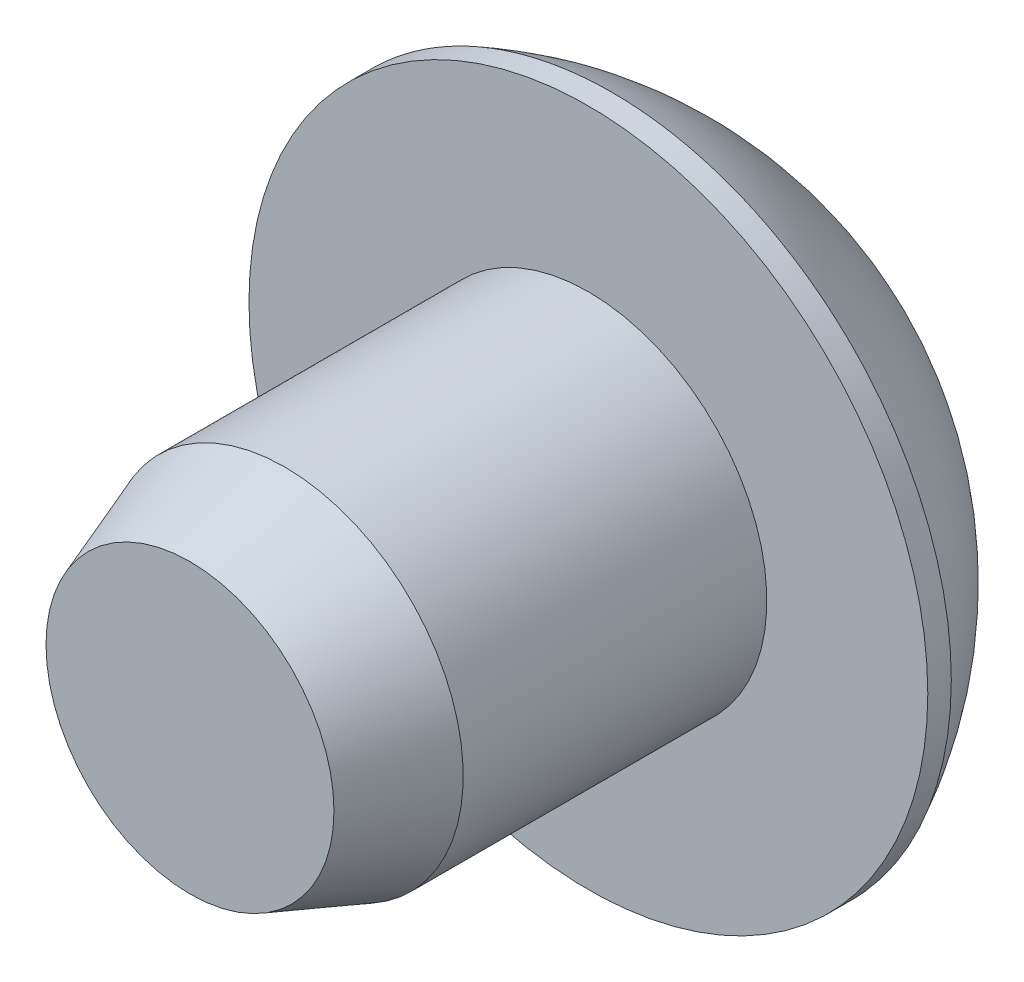
ISO-10303-21;
HEADER;
FILE_DESCRIPTION(('STEP AP214'),'2;1');
FILE_NAME('part.step','',(''),(''),'','','');
FILE_SCHEMA(('AUTOMOTIVE_DESIGN { 1 0 10303 214 1 1 1 1 }'));
ENDSEC;
DATA;
#1=APPLICATION_CONTEXT('core data for automotive mechanical design processes');
#2=APPLICATION_PROTOCOL_DEFINITION('international standard','automotive_design',2000,#1);
#3=PRODUCT_CONTEXT('',#1,'mechanical');
#4=PRODUCT('Part','Part','',(#3));
#5=PRODUCT_RELATED_PRODUCT_CATEGORY('part','',(#4));
#6=PRODUCT_DEFINITION_FORMATION('','',#4);
#7=PRODUCT_DEFINITION_CONTEXT('part definition',#1,'design');
#8=PRODUCT_DEFINITION('design','',#6,#7);
#9=PRODUCT_DEFINITION_SHAPE('','',#8);
#10=(LENGTH_UNIT() NAMED_UNIT(*) SI_UNIT(.MILLI.,.METRE.));
#11=(NAMED_UNIT(*) PLANE_ANGLE_UNIT() SI_UNIT($,.RADIAN.));
#12=(NAMED_UNIT(*) SI_UNIT($,.STERADIAN.) SOLID_ANGLE_UNIT());
#13=UNCERTAINTY_MEASURE_WITH_UNIT(LENGTH_MEASURE(1.E-05),#10,'distance_accuracy_value','');
#14=(GEOMETRIC_REPRESENTATION_CONTEXT(3) GLOBAL_UNCERTAINTY_ASSIGNED_CONTEXT((#13)) GLOBAL_UNIT_ASSIGNED_CONTEXT((#10,
#11,#12)) REPRESENTATION_CONTEXT('',''));
#15=CARTESIAN_POINT('',(0.,0.,0.));
#16=DIRECTION('',(0.,0.,1.));
#17=DIRECTION('',(1.,0.,0.));
#18=AXIS2_PLACEMENT_3D('',#15,#16,#17);
#19=CARTESIAN_POINT('',(0.,0.,-0.499533333333333));
#20=DIRECTION('',(0.,0.,-1.));
#21=DIRECTION('',(1.,0.,0.));
#22=AXIS2_PLACEMENT_3D('',#19,#20,#21);
#23=PLANE('',#22);
#24=CARTESIAN_POINT('',(0.,0.,-0.499533333311319));
#25=DIRECTION('',(0.,0.,1.));
#26=DIRECTION('',(0.,-1.,0.));
#27=AXIS2_PLACEMENT_3D('',#24,#25,#26);
#28=CIRCLE('',#27,0.361141443306678);
#29=CARTESIAN_POINT('',(0.,-0.361141443306678,-0.499533333311319));
#30=VERTEX_POINT('',#29);
#31=EDGE_CURVE('E40',#30,#30,#28,.T.);
#32=ORIENTED_EDGE('',*,*,#31,.F.);
#33=EDGE_LOOP('',(#32));
#34=FACE_BOUND('',#33,.T.);
#35=ADVANCED_FACE('F37',(#34),#23,.T.);
#36=CARTESIAN_POINT('',(0.,0.,-0.749299999995401));
#37=DIRECTION('',(0.,0.,-1.));
#38=DIRECTION('',(0.,-1.,0.));
#39=AXIS2_PLACEMENT_3D('',#36,#37,#38);
#40=CONICAL_SURFACE('',#39,0.793750000070759,1.04719755122676);
#41=ORIENTED_EDGE('',*,*,#31,.T.);
#42=EDGE_LOOP('',(#41));
#43=FACE_BOUND('',#42,.T.);
#44=CARTESIAN_POINT('',(0.,0.,-0.749299999995401));
#45=DIRECTION('',(0.,0.,1.));
#46=DIRECTION('',(0.,-1.,0.));
#47=AXIS2_PLACEMENT_3D('',#44,#45,#46);
#48=CIRCLE('',#47,0.793750000070759);
#49=CARTESIAN_POINT('',(0.793750000035379,0.,-0.7492999999977));
#50=VERTEX_POINT('',#49);
#51=CARTESIAN_POINT('',(0.39687500001769,-0.68740766428454,-0.7492999999977));
#52=VERTEX_POINT('',#51);
#53=EDGE_CURVE('E246',#50,#52,#48,.F.);
#54=ORIENTED_EDGE('',*,*,#53,.T.);
#55=CARTESIAN_POINT('',(0.,0.,-0.749299999995401));
#56=DIRECTION('',(0.,0.,1.));
#57=DIRECTION('',(0.,-1.,0.));
#58=AXIS2_PLACEMENT_3D('',#55,#56,#57);
#59=CIRCLE('',#58,0.793750000070759);
#60=CARTESIAN_POINT('',(-0.396875000017691,-0.68740766428454,-0.7492999999977));
#61=VERTEX_POINT('',#60);
#62=EDGE_CURVE('E250',#52,#61,#59,.F.);
#63=ORIENTED_EDGE('',*,*,#62,.T.);
#64=CARTESIAN_POINT('',(0.,0.,-0.749299999995401));
#65=DIRECTION('',(0.,0.,1.));
#66=DIRECTION('',(0.,-1.,0.));
#67=AXIS2_PLACEMENT_3D('',#64,#65,#66);
#68=CIRCLE('',#67,0.793750000070758);
#69=CARTESIAN_POINT('',(-0.79375000003538,0.,-0.7492999999977));
#70=VERTEX_POINT('',#69);
#71=EDGE_CURVE('E255',#61,#70,#68,.F.);
#72=ORIENTED_EDGE('',*,*,#71,.T.);
#73=CARTESIAN_POINT('',(0.,0.,-0.749299999995401));
#74=DIRECTION('',(0.,0.,1.));
#75=DIRECTION('',(0.,-1.,0.));
#76=AXIS2_PLACEMENT_3D('',#73,#74,#75);
#77=CIRCLE('',#76,0.793750000070759);
#78=CARTESIAN_POINT('',(-0.396875000017689,0.687407664284536,-0.7492999999977));
#79=VERTEX_POINT('',#78);
#80=EDGE_CURVE('E125',#70,#79,#77,.F.);
#81=ORIENTED_EDGE('',*,*,#80,.T.);
#82=CARTESIAN_POINT('',(0.,0.,-0.749299999995401));
#83=DIRECTION('',(0.,0.,1.));
#84=DIRECTION('',(0.,-1.,0.));
#85=AXIS2_PLACEMENT_3D('',#82,#83,#84);
#86=CIRCLE('',#85,0.793750000070759);
#87=CARTESIAN_POINT('',(0.396875000017689,0.687407664284537,-0.7492999999977));
#88=VERTEX_POINT('',#87);
#89=EDGE_CURVE('E261',#79,#88,#86,.F.);
#90=ORIENTED_EDGE('',*,*,#89,.T.);
#91=CARTESIAN_POINT('',(0.,0.,-0.749299999995401));
#92=DIRECTION('',(0.,0.,1.));
#93=DIRECTION('',(0.,-1.,0.));
#94=AXIS2_PLACEMENT_3D('',#91,#92,#93);
#95=CIRCLE('',#94,0.793750000070759);
#96=EDGE_CURVE('E123',#88,#50,#95,.F.);
#97=ORIENTED_EDGE('',*,*,#96,.T.);
#98=EDGE_LOOP('',(#54,#63,#72,#81,#90,#97));
#99=FACE_BOUND('',#98,.T.);
#100=ADVANCED_FACE('F257',(#43,#99),#40,.F.);
#101=CARTESIAN_POINT('',(0.793749999999999,-1.3748153285078,-0.7493));
#102=DIRECTION('',(0.,0.,-1.));
#103=DIRECTION('',(1.,0.,0.));
#104=AXIS2_PLACEMENT_3D('',#101,#102,#103);
#105=PLANE('',#104);
#106=DIRECTION('',(0.,1.,0.));
#107=VECTOR('',#106,1.);
#108=CARTESIAN_POINT('',(0.793749999999999,-0.458271776169272,-0.7493));
#109=LINE('',#108,#107);
#110=CARTESIAN_POINT('',(0.793749999999999,0.458271776169264,-0.7493));
#111=VERTEX_POINT('',#110);
#112=EDGE_CURVE('E118',#50,#111,#109,.T.);
#113=ORIENTED_EDGE('',*,*,#112,.F.);
#114=ORIENTED_EDGE('',*,*,#96,.F.);
#115=DIRECTION('',(-0.866025403784439,0.5,0.));
#116=VECTOR('',#115,1.);
#117=CARTESIAN_POINT('',(0.793749999999999,0.458271776169264,-0.7493));
#118=LINE('',#117,#116);
#119=EDGE_CURVE('E111',#111,#88,#118,.T.);
#120=ORIENTED_EDGE('',*,*,#119,.F.);
#121=EDGE_LOOP('',(#113,#114,#120));
#122=FACE_BOUND('',#121,.T.);
#123=ADVANCED_FACE('F121',(#122),#105,.T.);
#124=CARTESIAN_POINT('',(0.793749999999999,-1.3748153285078,-0.7493));
#125=DIRECTION('',(0.,0.,-1.));
#126=DIRECTION('',(1.,0.,0.));
#127=AXIS2_PLACEMENT_3D('',#124,#125,#126);
#128=PLANE('',#127);
#129=DIRECTION('',(0.866025403784439,0.5,0.));
#130=VECTOR('',#129,1.);
#131=CARTESIAN_POINT('',(0.,-0.916543552338537,-0.7493));
#132=LINE('',#131,#130);
#133=CARTESIAN_POINT('',(0.793749999999999,-0.458271776169272,-0.7493));
#134=VERTEX_POINT('',#133);
#135=EDGE_CURVE('E196',#52,#134,#132,.T.);
#136=ORIENTED_EDGE('',*,*,#135,.F.);
#137=ORIENTED_EDGE('',*,*,#53,.F.);
#138=DIRECTION('',(0.,1.,0.));
#139=VECTOR('',#138,1.);
#140=CARTESIAN_POINT('',(0.793749999999999,-0.458271776169272,-0.7493));
#141=LINE('',#140,#139);
#142=EDGE_CURVE('E102',#134,#50,#141,.T.);
#143=ORIENTED_EDGE('',*,*,#142,.F.);
#144=EDGE_LOOP('',(#136,#137,#143));
#145=FACE_BOUND('',#144,.T.);
#146=ADVANCED_FACE('F244',(#145),#128,.T.);
#147=CARTESIAN_POINT('',(0.793749999999999,-1.3748153285078,-0.7493));
#148=DIRECTION('',(0.,0.,-1.));
#149=DIRECTION('',(1.,0.,0.));
#150=AXIS2_PLACEMENT_3D('',#147,#148,#149);
#151=PLANE('',#150);
#152=DIRECTION('',(0.866025403784439,-0.5,0.));
#153=VECTOR('',#152,1.);
#154=CARTESIAN_POINT('',(-0.793750000000001,-0.458271776169271,-0.7493));
#155=LINE('',#154,#153);
#156=CARTESIAN_POINT('',(0.,-0.916543552338536,-0.7493));
#157=VERTEX_POINT('',#156);
#158=EDGE_CURVE('E189',#61,#157,#155,.T.);
#159=ORIENTED_EDGE('',*,*,#158,.F.);
#160=ORIENTED_EDGE('',*,*,#62,.F.);
#161=DIRECTION('',(0.866025403784439,0.5,0.));
#162=VECTOR('',#161,1.);
#163=CARTESIAN_POINT('',(0.,-0.916543552338537,-0.7493));
#164=LINE('',#163,#162);
#165=EDGE_CURVE('E117',#157,#52,#164,.T.);
#166=ORIENTED_EDGE('',*,*,#165,.F.);
#167=EDGE_LOOP('',(#159,#160,#166));
#168=FACE_BOUND('',#167,.T.);
#169=ADVANCED_FACE('F251',(#168),#151,.T.);
#170=CARTESIAN_POINT('',(0.793749999999999,-1.3748153285078,-0.7493));
#171=DIRECTION('',(0.,0.,-1.));
#172=DIRECTION('',(1.,0.,0.));
#173=AXIS2_PLACEMENT_3D('',#170,#171,#172);
#174=PLANE('',#173);
#175=DIRECTION('',(0.,1.,0.));
#176=VECTOR('',#175,1.);
#177=CARTESIAN_POINT('',(-0.793750000000001,0.458271776169261,-0.7493));
#178=LINE('',#177,#176);
#179=CARTESIAN_POINT('',(-0.793750000000001,-0.458271776169271,-0.7493));
#180=VERTEX_POINT('',#179);
#181=EDGE_CURVE('E182',#70,#180,#178,.F.);
#182=ORIENTED_EDGE('',*,*,#181,.F.);
#183=ORIENTED_EDGE('',*,*,#71,.F.);
#184=DIRECTION('',(0.866025403784439,-0.5,0.));
#185=VECTOR('',#184,1.);
#186=CARTESIAN_POINT('',(-0.793750000000001,-0.458271776169271,-0.7493));
#187=LINE('',#186,#185);
#188=EDGE_CURVE('E195',#180,#61,#187,.T.);
#189=ORIENTED_EDGE('',*,*,#188,.F.);
#190=EDGE_LOOP('',(#182,#183,#189));
#191=FACE_BOUND('',#190,.T.);
#192=ADVANCED_FACE('F293',(#191),#174,.T.);
#193=CARTESIAN_POINT('',(0.793749999999999,-1.3748153285078,-0.7493));
#194=DIRECTION('',(0.,0.,-1.));
#195=DIRECTION('',(1.,0.,0.));
#196=AXIS2_PLACEMENT_3D('',#193,#194,#195);
#197=PLANE('',#196);
#198=DIRECTION('',(-0.866025403784439,0.5,0.));
#199=VECTOR('',#198,1.);
#200=CARTESIAN_POINT('',(0.793749999999999,0.458271776169264,-0.7493));
#201=LINE('',#200,#199);
#202=CARTESIAN_POINT('',(0.,0.916543552338526,-0.7493));
#203=VERTEX_POINT('',#202);
#204=EDGE_CURVE('E95',#88,#203,#201,.T.);
#205=ORIENTED_EDGE('',*,*,#204,.F.);
#206=ORIENTED_EDGE('',*,*,#89,.F.);
#207=DIRECTION('',(-0.866025403784438,-0.5,0.));
#208=VECTOR('',#207,1.);
#209=CARTESIAN_POINT('',(0.,0.916543552338528,-0.7493));
#210=LINE('',#209,#208);
#211=EDGE_CURVE('E181',#203,#79,#210,.T.);
#212=ORIENTED_EDGE('',*,*,#211,.F.);
#213=EDGE_LOOP('',(#205,#206,#212));
#214=FACE_BOUND('',#213,.T.);
#215=ADVANCED_FACE('F289',(#214),#197,.T.);
#216=CARTESIAN_POINT('',(0.793749999999999,-1.3748153285078,-0.7493));
#217=DIRECTION('',(0.,0.,-1.));
#218=DIRECTION('',(1.,0.,0.));
#219=AXIS2_PLACEMENT_3D('',#216,#217,#218);
#220=PLANE('',#219);
#221=DIRECTION('',(-0.866025403784438,-0.5,0.));
#222=VECTOR('',#221,1.);
#223=CARTESIAN_POINT('',(0.,0.916543552338528,-0.7493));
#224=LINE('',#223,#222);
#225=CARTESIAN_POINT('',(-0.793750000000001,0.458271776169261,-0.7493));
#226=VERTEX_POINT('',#225);
#227=EDGE_CURVE('E175',#79,#226,#224,.T.);
#228=ORIENTED_EDGE('',*,*,#227,.F.);
#229=ORIENTED_EDGE('',*,*,#80,.F.);
#230=DIRECTION('',(0.,1.,0.));
#231=VECTOR('',#230,1.);
#232=CARTESIAN_POINT('',(-0.793750000000001,0.458271776169261,-0.7493));
#233=LINE('',#232,#231);
#234=EDGE_CURVE('E188',#226,#70,#233,.F.);
#235=ORIENTED_EDGE('',*,*,#234,.F.);
#236=EDGE_LOOP('',(#228,#229,#235));
#237=FACE_BOUND('',#236,.T.);
#238=ADVANCED_FACE('F284',(#237),#220,.T.);
#239=CARTESIAN_POINT('',(0.793749999999999,0.458271776169264,-0.7493));
#240=DIRECTION('',(0.5,0.866025403784439,0.));
#241=DIRECTION('',(-0.866025403784439,0.5,0.));
#242=AXIS2_PLACEMENT_3D('',#239,#240,#241);
#243=PLANE('',#242);
#244=CARTESIAN_POINT('',(0.793749999984981,0.458271776175997,-1.49860000001476));
#245=CARTESIAN_POINT('',(0.766468387401486,0.474022822546245,-1.48286414413926));
#246=CARTESIAN_POINT('',(0.738730682436422,0.490037193975037,-1.46805255795257));
#247=CARTESIAN_POINT('',(0.682170655102864,0.522692140981815,-1.44093317103073));
#248=CARTESIAN_POINT('',(0.653342956809629,0.539335820351393,-1.42864045455148));
#249=CARTESIAN_POINT('',(0.595213203753814,0.572897048925995,-1.40758310076897));
#250=CARTESIAN_POINT('',(0.565925946680102,0.589806054681364,-1.39876554808624));
#251=CARTESIAN_POINT('',(0.506707298441107,0.62399595718322,-1.38517986145879));
#252=CARTESIAN_POINT('',(0.476777713911571,0.641275810868071,-1.38040159196537));
#253=CARTESIAN_POINT('',(0.425189875514825,0.671060063253339,-1.3760917397324));
#254=CARTESIAN_POINT('',(0.403598614444802,0.683525783644262,-1.37545489995247));
#255=CARTESIAN_POINT('',(0.360457981374222,0.708433039760572,-1.37652821886569));
#256=CARTESIAN_POINT('',(0.33890861967972,0.720874569535758,-1.37823889600417));
#257=CARTESIAN_POINT('',(0.274568421822292,0.758021400088457,-1.38677913492328));
#258=CARTESIAN_POINT('',(0.232097868092202,0.782541785717157,-1.39701786578682));
#259=CARTESIAN_POINT('',(0.157588950855752,0.825559529140649,-1.42171553387218));
#260=CARTESIAN_POINT('',(0.125199877518035,0.844259369350982,-1.43487535892107));
#261=CARTESIAN_POINT('',(0.0616892985520822,0.880927219213364,-1.46451739489941));
#262=CARTESIAN_POINT('',(0.0305640531904897,0.898897388001473,-1.48098879063839));
#263=CARTESIAN_POINT('',(1.39644451711373E-11,0.916543552330466,-1.49860000001396));
#264=B_SPLINE_CURVE_WITH_KNOTS('',3,(#244,#245,#246,#247,#248,#249,#250,#251,#252,#253,#254,
#255,#256,#257,#258,#259,#260,#261,#262,#263),.UNSPECIFIED.,.F.,.F.,(4,2,2,2,2,2,2,2,2,4),(0.,
0.10571396381212,0.212043598466134,0.316685078051546,0.421063200546594,0.49577344029324,
0.570500182331605,0.719996020142865,0.838779765394142,0.957181701199463),.UNSPECIFIED.);
#265=CARTESIAN_POINT('',(0.793749999993069,0.458271776142038,-1.49860000000241));
#266=VERTEX_POINT('',#265);
#267=CARTESIAN_POINT('',(0.,0.916543552322913,-1.49860000000641));
#268=VERTEX_POINT('',#267);
#269=EDGE_CURVE('E115',#266,#268,#264,.T.);
#270=ORIENTED_EDGE('',*,*,#269,.F.);
#271=DIRECTION('',(0.,0.,1.));
#272=VECTOR('',#271,1.);
#273=CARTESIAN_POINT('',(0.793749999999999,0.458271776169264,-0.7493));
#274=LINE('',#273,#272);
#275=EDGE_CURVE('E108',#111,#266,#274,.F.);
#276=ORIENTED_EDGE('',*,*,#275,.F.);
#277=ORIENTED_EDGE('',*,*,#119,.T.);
#278=ORIENTED_EDGE('',*,*,#204,.T.);
#279=DIRECTION('',(0.,0.,-1.));
#280=VECTOR('',#279,1.);
#281=CARTESIAN_POINT('',(0.,0.916543552338524,-0.7493));
#282=LINE('',#281,#280);
#283=EDGE_CURVE('E167',#268,#203,#282,.F.);
#284=ORIENTED_EDGE('',*,*,#283,.F.);
#285=EDGE_LOOP('',(#270,#276,#277,#278,#284));
#286=FACE_BOUND('',#285,.T.);
#287=ADVANCED_FACE('F110',(#286),#243,.F.);
#288=CARTESIAN_POINT('',(0.793749999999999,-0.458271776169272,-0.7493));
#289=DIRECTION('',(1.,0.,0.));
#290=DIRECTION('',(0.,0.,1.));
#291=AXIS2_PLACEMENT_3D('',#288,#289,#290);
#292=PLANE('',#291);
#293=CARTESIAN_POINT('',(0.793749999998316,-0.458271776152903,-1.49860000001477));
#294=CARTESIAN_POINT('',(0.793749999999393,-0.426975491049293,-1.48296651779682));
#295=CARTESIAN_POINT('',(0.793749999999837,-0.39515931237104,-1.46824581300037));
#296=CARTESIAN_POINT('',(0.793750000000163,-0.330270832110431,-1.44126245966619));
#297=CARTESIAN_POINT('',(0.793750000000043,-0.297191783713648,-1.42901617939526));
#298=CARTESIAN_POINT('',(0.793749999999956,-0.230077553253918,-1.40786961389565));
#299=CARTESIAN_POINT('',(0.793749999999988,-0.196046036720344,-1.39895800475126));
#300=CARTESIAN_POINT('',(0.793750000000011,-0.127237343113491,-1.38523771300879));
#301=CARTESIAN_POINT('',(0.793750000000001,-0.0924628174584713,-1.38041634273154));
#302=CARTESIAN_POINT('',(0.793749999999999,-0.0479673001822662,-1.37719659968676));
#303=CARTESIAN_POINT('',(0.793749999999999,-0.0383784693408378,-1.37667618275069));
#304=CARTESIAN_POINT('',(0.793749999999999,-0.0191940940646776,-1.37598033825731));
#305=CARTESIAN_POINT('',(0.793749999999999,-0.00959855611422884,-1.37580472329213));
#306=CARTESIAN_POINT('',(0.793749999999999,0.0481505552443495,-1.37581509798472));
#307=CARTESIAN_POINT('',(0.793749999999999,0.0963770615083965,-1.38028642997643));
#308=CARTESIAN_POINT('',(0.793749999999999,0.191553320403348,-1.39722654668576));
#309=CARTESIAN_POINT('',(0.793749999999999,0.238494653341624,-1.40973891227007));
#310=CARTESIAN_POINT('',(0.793749999999999,0.314361329209395,-1.43532182934164));
#311=CARTESIAN_POINT('',(0.793749999999999,0.343890227735906,-1.4466947344021));
#312=CARTESIAN_POINT('',(0.793749999999999,0.401829965141459,-1.47134366658123));
#313=CARTESIAN_POINT('',(0.793749999999999,0.430248560019513,-1.48460133532251));
#314=CARTESIAN_POINT('',(0.793749999999999,0.458271776153172,-1.49860000001398));
#315=B_SPLINE_CURVE_WITH_KNOTS('',3,(#293,#294,#295,#296,#297,#298,#299,#300,#301,#302,#303,
#304,#305,#306,#307,#308,#309,#310,#311,#312,#313,#314),.UNSPECIFIED.,.F.,.F.,(4,2,2,2,2,2,2,2,
2,2,4),(0.,0.105023602064034,0.210720694297195,0.316055529705702,0.421062415372318,
0.449866476680361,0.478654877974874,0.623070089013118,0.768274680513024,0.863134860534031,
0.957127400492166),.UNSPECIFIED.);
#316=CARTESIAN_POINT('',(0.793749999972953,-0.458271776176887,-1.49860000000242));
#317=VERTEX_POINT('',#316);
#318=EDGE_CURVE('E271',#317,#266,#315,.T.);
#319=ORIENTED_EDGE('',*,*,#318,.F.);
#320=DIRECTION('',(0.,0.,-1.));
#321=VECTOR('',#320,1.);
#322=CARTESIAN_POINT('',(0.793749999999999,-0.458271776169272,-0.7493));
#323=LINE('',#322,#321);
#324=EDGE_CURVE('E192',#134,#317,#323,.T.);
#325=ORIENTED_EDGE('',*,*,#324,.F.);
#326=ORIENTED_EDGE('',*,*,#142,.T.);
#327=ORIENTED_EDGE('',*,*,#112,.T.);
#328=ORIENTED_EDGE('',*,*,#275,.T.);
#329=EDGE_LOOP('',(#319,#325,#326,#327,#328));
#330=FACE_BOUND('',#329,.T.);
#331=ADVANCED_FACE('F127',(#330),#292,.F.);
#332=CARTESIAN_POINT('',(0.,-0.916543552338537,-0.7493));
#333=DIRECTION('',(0.5,-0.866025403784439,0.));
#334=DIRECTION('',(0.866025403784439,0.5,0.));
#335=AXIS2_PLACEMENT_3D('',#332,#333,#334);
#336=PLANE('',#335);
#337=CARTESIAN_POINT('',(1.33355930979855E-11,-0.916543552328894,-1.49860000001477));
#338=CARTESIAN_POINT('',(0.0272816125979058,-0.900792505960509,-1.48286414413926));
#339=CARTESIAN_POINT('',(0.0550193175634121,-0.884778134532483,-1.46805255795258));
#340=CARTESIAN_POINT('',(0.111579344897296,-0.852123187526269,-1.44093317103074));
#341=CARTESIAN_POINT('',(0.140407043190412,-0.835479508156483,-1.42864045455149));
#342=CARTESIAN_POINT('',(0.19853679624614,-0.801918279581732,-1.40758310076898));
#343=CARTESIAN_POINT('',(0.227824053319883,-0.785009273826417,-1.39876554808625));
#344=CARTESIAN_POINT('',(0.287042701558901,-0.750819371324601,-1.3851798614588));
#345=CARTESIAN_POINT('',(0.316972286088428,-0.733539517639734,-1.38040159196538));
#346=CARTESIAN_POINT('',(0.368560124485171,-0.703755265254459,-1.37609173973241));
#347=CARTESIAN_POINT('',(0.390151385555195,-0.691289544863538,-1.37545489995248));
#348=CARTESIAN_POINT('',(0.433292018625776,-0.666382288747229,-1.3765282188657));
#349=CARTESIAN_POINT('',(0.454841380320279,-0.653940758972043,-1.37823889600418));
#350=CARTESIAN_POINT('',(0.519181578177706,-0.616793928419343,-1.38677913492328));
#351=CARTESIAN_POINT('',(0.561652131907797,-0.592273542790643,-1.39701786578682));
#352=CARTESIAN_POINT('',(0.636161049144245,-0.549255799367152,-1.42171553387219));
#353=CARTESIAN_POINT('',(0.66855012248196,-0.53055595915682,-1.43487535892108));
#354=CARTESIAN_POINT('',(0.732060701447909,-0.49388810929444,-1.46451739489941));
#355=CARTESIAN_POINT('',(0.7631859468095,-0.475917940506332,-1.48098879063839));
#356=CARTESIAN_POINT('',(0.793749999986024,-0.458271776177341,-1.49860000001396));
#357=B_SPLINE_CURVE_WITH_KNOTS('',3,(#337,#338,#339,#340,#341,#342,#343,#344,#345,#346,#347,
#348,#349,#350,#351,#352,#353,#354,#355,#356),.UNSPECIFIED.,.F.,.F.,(4,2,2,2,2,2,2,2,2,4),(0.,
0.105713963812121,0.212043598466135,0.316685078051547,0.421063200546596,0.495773440293243,
0.570500182331608,0.719996020142868,0.838779765394138,0.957181701199452),.UNSPECIFIED.);
#358=CARTESIAN_POINT('',(-2.01206942672553E-11,-0.916543552318919,-1.49860000000242));
#359=VERTEX_POINT('',#358);
#360=EDGE_CURVE('E567',#359,#317,#357,.T.);
#361=ORIENTED_EDGE('',*,*,#360,.F.);
#362=DIRECTION('',(0.,0.,-1.));
#363=VECTOR('',#362,1.);
#364=CARTESIAN_POINT('',(0.,-0.916543552338536,-0.7493));
#365=LINE('',#364,#363);
#366=EDGE_CURVE('E185',#157,#359,#365,.T.);
#367=ORIENTED_EDGE('',*,*,#366,.F.);
#368=ORIENTED_EDGE('',*,*,#165,.T.);
#369=ORIENTED_EDGE('',*,*,#135,.T.);
#370=ORIENTED_EDGE('',*,*,#324,.T.);
#371=EDGE_LOOP('',(#361,#367,#368,#369,#370));
#372=FACE_BOUND('',#371,.T.);
#373=ADVANCED_FACE('F237',(#372),#336,.F.);
#374=CARTESIAN_POINT('',(-0.793750000000001,-0.458271776169271,-0.7493));
#375=DIRECTION('',(-0.5,-0.866025403784439,0.));
#376=DIRECTION('',(0.866025403784439,-0.5,0.));
#377=AXIS2_PLACEMENT_3D('',#374,#375,#376);
#378=PLANE('',#377);
#379=CARTESIAN_POINT('',(-0.793749999984982,-0.458271776176001,-1.49860000001477));
#380=CARTESIAN_POINT('',(-0.766468387401489,-0.474022822546251,-1.48286414413926));
#381=CARTESIAN_POINT('',(-0.738730682436426,-0.490037193975043,-1.46805255795258));
#382=CARTESIAN_POINT('',(-0.682170655102868,-0.522692140981822,-1.44093317103074));
#383=CARTESIAN_POINT('',(-0.653342956809633,-0.5393358203514,-1.42864045455149));
#384=CARTESIAN_POINT('',(-0.595213203753818,-0.572897048926001,-1.40758310076898));
#385=CARTESIAN_POINT('',(-0.565925946680107,-0.589806054681371,-1.39876554808625));
#386=CARTESIAN_POINT('',(-0.506707298441112,-0.623995957183226,-1.3851798614588));
#387=CARTESIAN_POINT('',(-0.476777713911577,-0.641275810868077,-1.38040159196538));
#388=CARTESIAN_POINT('',(-0.42518987551483,-0.671060063253345,-1.37609173973241));
#389=CARTESIAN_POINT('',(-0.403598614444807,-0.683525783644267,-1.37545489995248));
#390=CARTESIAN_POINT('',(-0.360457981374227,-0.708433039760579,-1.3765282188657));
#391=CARTESIAN_POINT('',(-0.338908619679724,-0.720874569535764,-1.37823889600418));
#392=CARTESIAN_POINT('',(-0.274568421822296,-0.758021400088463,-1.38677913492329));
#393=CARTESIAN_POINT('',(-0.232097868092206,-0.782541785717164,-1.39701786578682));
#394=CARTESIAN_POINT('',(-0.157588950855757,-0.825559529140655,-1.42171553387219));
#395=CARTESIAN_POINT('',(-0.125199877518042,-0.844259369350987,-1.43487535892108));
#396=CARTESIAN_POINT('',(-0.0616892985520926,-0.880927219213367,-1.46451739489941));
#397=CARTESIAN_POINT('',(-0.0305640531905017,-0.898897388001475,-1.48098879063839));
#398=CARTESIAN_POINT('',(-1.39777830432795E-11,-0.916543552330467,-1.49860000001397));
#399=B_SPLINE_CURVE_WITH_KNOTS('',3,(#379,#380,#381,#382,#383,#384,#385,#386,#387,#388,#389,
#390,#391,#392,#393,#394,#395,#396,#397,#398),.UNSPECIFIED.,.F.,.F.,(4,2,2,2,2,2,2,2,2,4),(0.,
0.10571396381212,0.212043598466133,0.316685078051544,0.421063200546592,0.495773440293239,
0.570500182331604,0.719996020142865,0.838779765394135,0.95718170119945),.UNSPECIFIED.);
#400=CARTESIAN_POINT('',(-0.793749999993072,-0.45827177614204,-1.49860000000242));
#401=VERTEX_POINT('',#400);
#402=EDGE_CURVE('E562',#401,#359,#399,.T.);
#403=ORIENTED_EDGE('',*,*,#402,.F.);
#404=DIRECTION('',(0.,0.,-1.));
#405=VECTOR('',#404,1.);
#406=CARTESIAN_POINT('',(-0.793750000000001,-0.458271776169271,-0.7493));
#407=LINE('',#406,#405);
#408=EDGE_CURVE('E178',#180,#401,#407,.T.);
#409=ORIENTED_EDGE('',*,*,#408,.F.);
#410=ORIENTED_EDGE('',*,*,#188,.T.);
#411=ORIENTED_EDGE('',*,*,#158,.T.);
#412=ORIENTED_EDGE('',*,*,#366,.T.);
#413=EDGE_LOOP('',(#403,#409,#410,#411,#412));
#414=FACE_BOUND('',#413,.T.);
#415=ADVANCED_FACE('F374',(#414),#378,.F.);
#416=CARTESIAN_POINT('',(-0.793750000000001,0.458271776169261,-0.7493));
#417=DIRECTION('',(-1.,0.,0.));
#418=DIRECTION('',(0.,0.,-1.));
#419=AXIS2_PLACEMENT_3D('',#416,#417,#418);
#420=PLANE('',#419);
#421=CARTESIAN_POINT('',(-0.793749999998323,0.458271776152889,-1.49860000001476));
#422=CARTESIAN_POINT('',(-0.793749999999397,0.426769683414265,-1.48286414413926));
#423=CARTESIAN_POINT('',(-0.793749999999839,0.394740940557458,-1.46805255795257));
#424=CARTESIAN_POINT('',(-0.793750000000164,0.329431046544489,-1.44093317103073));
#425=CARTESIAN_POINT('',(-0.793750000000044,0.296143687805137,-1.42864045455148));
#426=CARTESIAN_POINT('',(-0.793749999999958,0.229021230655807,-1.40758310076896));
#427=CARTESIAN_POINT('',(-0.79374999999999,0.195203219145135,-1.39876554808622));
#428=CARTESIAN_POINT('',(-0.793750000000012,0.126823414141485,-1.38517986145877));
#429=CARTESIAN_POINT('',(-0.793750000000004,0.092263706771778,-1.38040159196534));
#430=CARTESIAN_POINT('',(-0.793749999999999,0.0326952020012599,-1.37609173973236));
#431=CARTESIAN_POINT('',(-0.793750000000001,0.00776376121943092,-1.37545489995242));
#432=CARTESIAN_POINT('',(-0.793750000000002,-0.0420507510131619,-1.37652821886563));
#433=CARTESIAN_POINT('',(-0.793750000000001,-0.0669338105635199,-1.37823889600411));
#434=CARTESIAN_POINT('',(-0.793750000000001,-0.141227471668879,-1.38677913492319));
#435=CARTESIAN_POINT('',(-0.793750000000001,-0.190268242926254,-1.39701786578672));
#436=CARTESIAN_POINT('',(-0.793750000000001,-0.276303729773267,-1.42171553387207));
#437=CARTESIAN_POINT('',(-0.793750000000001,-0.313703410193983,-1.43487535892098));
#438=CARTESIAN_POINT('',(-0.793750000000001,-0.387039109918843,-1.46451739489936));
#439=CARTESIAN_POINT('',(-0.793750000000001,-0.422979447495106,-1.48098879063836));
#440=CARTESIAN_POINT('',(-0.793750000000001,-0.458271776153135,-1.49860000001397));
#441=B_SPLINE_CURVE_WITH_KNOTS('',3,(#421,#422,#423,#424,#425,#426,#427,#428,#429,#430,#431,
#432,#433,#434,#435,#436,#437,#438,#439,#440),.UNSPECIFIED.,.F.,.F.,(4,2,2,2,2,2,2,2,2,4),(0.,
0.105713963812089,0.212043598466072,0.316685078051454,0.421063200546472,0.495773440293077,
0.5705001823314,0.719996020142576,0.838779765394009,0.957181701199487),.UNSPECIFIED.);
#442=CARTESIAN_POINT('',(-0.793749999972958,0.458271776176872,-1.49860000000241));
#443=VERTEX_POINT('',#442);
#444=EDGE_CURVE('E552',#443,#401,#441,.T.);
#445=ORIENTED_EDGE('',*,*,#444,.F.);
#446=DIRECTION('',(0.,0.,-1.));
#447=VECTOR('',#446,1.);
#448=CARTESIAN_POINT('',(-0.793750000000001,0.458271776169261,-0.7493));
#449=LINE('',#448,#447);
#450=EDGE_CURVE('E170',#226,#443,#449,.T.);
#451=ORIENTED_EDGE('',*,*,#450,.F.);
#452=ORIENTED_EDGE('',*,*,#234,.T.);
#453=ORIENTED_EDGE('',*,*,#181,.T.);
#454=ORIENTED_EDGE('',*,*,#408,.T.);
#455=EDGE_LOOP('',(#445,#451,#452,#453,#454));
#456=FACE_BOUND('',#455,.T.);
#457=ADVANCED_FACE('F382',(#456),#420,.F.);
#458=CARTESIAN_POINT('',(0.,0.916543552338528,-0.7493));
#459=DIRECTION('',(-0.5,0.866025403784438,0.));
#460=DIRECTION('',(-0.866025403784438,-0.5,0.));
#461=AXIS2_PLACEMENT_3D('',#458,#459,#460);
#462=PLANE('',#461);
#463=CARTESIAN_POINT('',(-1.33406651125811E-11,0.916543552328888,-1.49860000001476));
#464=CARTESIAN_POINT('',(-0.0272816125979096,0.9007925059605,-1.48286414413925));
#465=CARTESIAN_POINT('',(-0.0550193175634151,0.884778134532473,-1.46805255795257));
#466=CARTESIAN_POINT('',(-0.111579344897298,0.852123187526259,-1.44093317103073));
#467=CARTESIAN_POINT('',(-0.140407043190413,0.835479508156473,-1.42864045455148));
#468=CARTESIAN_POINT('',(-0.198536796246142,0.801918279581722,-1.40758310076897));
#469=CARTESIAN_POINT('',(-0.227824053319884,0.785009273826408,-1.39876554808624));
#470=CARTESIAN_POINT('',(-0.287042701558902,0.750819371324591,-1.38517986145879));
#471=CARTESIAN_POINT('',(-0.316972286088429,0.733539517639725,-1.38040159196537));
#472=CARTESIAN_POINT('',(-0.368560124485171,0.70375526525445,-1.3760917397324));
#473=CARTESIAN_POINT('',(-0.390151385555195,0.69128954486353,-1.37545489995247));
#474=CARTESIAN_POINT('',(-0.433292018625775,0.66638228874722,-1.37652821886569));
#475=CARTESIAN_POINT('',(-0.454841380320278,0.653940758972034,-1.37823889600417));
#476=CARTESIAN_POINT('',(-0.519181578177704,0.616793928419335,-1.38677913492328));
#477=CARTESIAN_POINT('',(-0.561652131907795,0.592273542790635,-1.39701786578682));
#478=CARTESIAN_POINT('',(-0.636161049144246,0.549255799367142,-1.42171553387218));
#479=CARTESIAN_POINT('',(-0.668550122481962,0.530555959156809,-1.43487535892107));
#480=CARTESIAN_POINT('',(-0.732060701447916,0.493888109294426,-1.46451739489941));
#481=CARTESIAN_POINT('',(-0.763185946809509,0.475917940506318,-1.48098879063839));
#482=CARTESIAN_POINT('',(-0.793749999986035,0.458271776177325,-1.49860000001396));
#483=B_SPLINE_CURVE_WITH_KNOTS('',3,(#463,#464,#465,#466,#467,#468,#469,#470,#471,#472,#473,
#474,#475,#476,#477,#478,#479,#480,#481,#482),.UNSPECIFIED.,.F.,.F.,(4,2,2,2,2,2,2,2,2,4),(0.,
0.10571396381212,0.212043598466133,0.316685078051544,0.421063200546591,0.495773440293238,
0.570500182331602,0.719996020142862,0.838779765394141,0.957181701199463),.UNSPECIFIED.);
#484=EDGE_CURVE('E547',#268,#443,#483,.T.);
#485=ORIENTED_EDGE('',*,*,#484,.F.);
#486=ORIENTED_EDGE('',*,*,#283,.T.);
#487=ORIENTED_EDGE('',*,*,#211,.T.);
#488=ORIENTED_EDGE('',*,*,#227,.T.);
#489=ORIENTED_EDGE('',*,*,#450,.T.);
#490=EDGE_LOOP('',(#485,#486,#487,#488,#489));
#491=FACE_BOUND('',#490,.T.);
#492=ADVANCED_FACE('F392',(#491),#462,.F.);
#493=CARTESIAN_POINT('',(0.,0.,-1.49859999993396));
#494=DIRECTION('',(0.,0.,-1.));
#495=DIRECTION('',(1.,0.,0.));
#496=AXIS2_PLACEMENT_3D('',#493,#494,#495);
#497=CONICAL_SURFACE('',#496,0.916543552250459,0.785398163167608);
#498=ORIENTED_EDGE('',*,*,#269,.T.);
#499=CARTESIAN_POINT('',(0.,0.,-1.4985999999908));
#500=DIRECTION('',(0.,0.,1.));
#501=DIRECTION('',(1.,0.,0.));
#502=AXIS2_PLACEMENT_3D('',#499,#500,#501);
#503=CIRCLE('',#502,0.916543552307303);
#504=EDGE_CURVE('E544',#268,#266,#503,.F.);
#505=ORIENTED_EDGE('',*,*,#504,.T.);
#506=EDGE_LOOP('',(#498,#505));
#507=FACE_BOUND('',#506,.T.);
#508=ADVANCED_FACE('F278',(#507),#497,.F.);
#509=CARTESIAN_POINT('',(0.,0.,-1.49859999993396));
#510=DIRECTION('',(0.,0.,-1.));
#511=DIRECTION('',(1.,0.,0.));
#512=AXIS2_PLACEMENT_3D('',#509,#510,#511);
#513=CONICAL_SURFACE('',#512,0.916543552250459,0.785398163397448);
#514=ORIENTED_EDGE('',*,*,#318,.T.);
#515=CARTESIAN_POINT('',(0.,0.,-1.4985999999908));
#516=DIRECTION('',(0.,0.,1.));
#517=DIRECTION('',(1.,0.,0.));
#518=AXIS2_PLACEMENT_3D('',#515,#516,#517);
#519=CIRCLE('',#518,0.916543552307303);
#520=EDGE_CURVE('E541',#266,#317,#519,.F.);
#521=ORIENTED_EDGE('',*,*,#520,.T.);
#522=EDGE_LOOP('',(#514,#521));
#523=FACE_BOUND('',#522,.T.);
#524=ADVANCED_FACE('F410',(#523),#513,.F.);
#525=CARTESIAN_POINT('',(0.,0.,-1.49859999993396));
#526=DIRECTION('',(0.,0.,-1.));
#527=DIRECTION('',(1.,0.,0.));
#528=AXIS2_PLACEMENT_3D('',#525,#526,#527);
#529=CONICAL_SURFACE('',#528,0.916543552250459,0.785398163167608);
#530=ORIENTED_EDGE('',*,*,#360,.T.);
#531=CARTESIAN_POINT('',(0.,0.,-1.4985999999908));
#532=DIRECTION('',(0.,0.,1.));
#533=DIRECTION('',(1.,0.,0.));
#534=AXIS2_PLACEMENT_3D('',#531,#532,#533);
#535=CIRCLE('',#534,0.916543552307303);
#536=EDGE_CURVE('E538',#317,#359,#535,.F.);
#537=ORIENTED_EDGE('',*,*,#536,.T.);
#538=EDGE_LOOP('',(#530,#537));
#539=FACE_BOUND('',#538,.T.);
#540=ADVANCED_FACE('F419',(#539),#529,.F.);
#541=CARTESIAN_POINT('',(0.,0.,-1.49859999993396));
#542=DIRECTION('',(0.,0.,-1.));
#543=DIRECTION('',(1.,0.,0.));
#544=AXIS2_PLACEMENT_3D('',#541,#542,#543);
#545=CONICAL_SURFACE('',#544,0.916543552250459,0.785398163167608);
#546=ORIENTED_EDGE('',*,*,#402,.T.);
#547=CARTESIAN_POINT('',(0.,0.,-1.4985999999908));
#548=DIRECTION('',(0.,0.,1.));
#549=DIRECTION('',(1.,0.,0.));
#550=AXIS2_PLACEMENT_3D('',#547,#548,#549);
#551=CIRCLE('',#550,0.916543552307303);
#552=EDGE_CURVE('E533',#359,#401,#551,.F.);
#553=ORIENTED_EDGE('',*,*,#552,.T.);
#554=EDGE_LOOP('',(#546,#553));
#555=FACE_BOUND('',#554,.T.);
#556=ADVANCED_FACE('F428',(#555),#545,.F.);
#557=CARTESIAN_POINT('',(0.,0.,-1.49859999993396));
#558=DIRECTION('',(0.,0.,-1.));
#559=DIRECTION('',(1.,0.,0.));
#560=AXIS2_PLACEMENT_3D('',#557,#558,#559);
#561=CONICAL_SURFACE('',#560,0.916543552250459,0.785398163167394);
#562=ORIENTED_EDGE('',*,*,#444,.T.);
#563=CARTESIAN_POINT('',(0.,0.,-1.4985999999908));
#564=DIRECTION('',(0.,0.,1.));
#565=DIRECTION('',(1.,0.,0.));
#566=AXIS2_PLACEMENT_3D('',#563,#564,#565);
#567=CIRCLE('',#566,0.916543552307303);
#568=EDGE_CURVE('E531',#401,#443,#567,.F.);
#569=ORIENTED_EDGE('',*,*,#568,.T.);
#570=EDGE_LOOP('',(#562,#569));
#571=FACE_BOUND('',#570,.T.);
#572=ADVANCED_FACE('F438',(#571),#561,.F.);
#573=CARTESIAN_POINT('',(0.,0.,-1.49859999993396));
#574=DIRECTION('',(0.,0.,-1.));
#575=DIRECTION('',(1.,0.,0.));
#576=AXIS2_PLACEMENT_3D('',#573,#574,#575);
#577=CONICAL_SURFACE('',#576,0.916543552250459,0.785398163167608);
#578=ORIENTED_EDGE('',*,*,#484,.T.);
#579=CARTESIAN_POINT('',(0.,0.,-1.4985999999908));
#580=DIRECTION('',(0.,0.,1.));
#581=DIRECTION('',(1.,0.,0.));
#582=AXIS2_PLACEMENT_3D('',#579,#580,#581);
#583=CIRCLE('',#582,0.916543552307303);
#584=EDGE_CURVE('E55',#443,#268,#583,.F.);
#585=ORIENTED_EDGE('',*,*,#584,.T.);
#586=EDGE_LOOP('',(#578,#585));
#587=FACE_BOUND('',#586,.T.);
#588=ADVANCED_FACE('F448',(#587),#577,.F.);
#589=CARTESIAN_POINT('',(0.,0.,3.175));
#590=DIRECTION('',(0.,0.,1.));
#591=DIRECTION('',(0.,1.,0.));
#592=AXIS2_PLACEMENT_3D('',#589,#590,#591);
#593=PLANE('',#592);
#594=CARTESIAN_POINT('',(0.,0.,3.17499999999882));
#595=DIRECTION('',(0.,0.,1.));
#596=DIRECTION('',(0.,-1.,0.));
#597=AXIS2_PLACEMENT_3D('',#594,#595,#596);
#598=CIRCLE('',#597,1.14747368445227);
#599=CARTESIAN_POINT('',(0.,-1.14747368445227,3.17499999999882));
#600=VERTEX_POINT('',#599);
#601=EDGE_CURVE('E148',#600,#600,#598,.T.);
#602=ORIENTED_EDGE('',*,*,#601,.T.);
#603=EDGE_LOOP('',(#602));
#604=FACE_BOUND('',#603,.T.);
#605=ADVANCED_FACE('F458',(#604),#593,.T.);
#606=CARTESIAN_POINT('',(0.,0.,-1.4986));
#607=DIRECTION('',(0.,0.,-1.));
#608=DIRECTION('',(1.,0.,0.));
#609=AXIS2_PLACEMENT_3D('',#606,#607,#608);
#610=PLANE('',#609);
#611=CARTESIAN_POINT('',(0.,-1.4224,-1.4986));
#612=CARTESIAN_POINT('',(-0.0798374015068039,-1.42239547960122,-1.49859999999984));
#613=CARTESIAN_POINT('',(-0.159816890979208,-1.41564125649136,-1.49859999999987));
#614=CARTESIAN_POINT('',(-0.278015341078682,-1.39554324162256,-1.49860000000006));
#615=CARTESIAN_POINT('',(-0.317169786053096,-1.38716526414384,-1.49860000000016));
#616=CARTESIAN_POINT('',(-0.394672406919858,-1.36713459799427,-1.49859999999984));
#617=CARTESIAN_POINT('',(-0.433019901263238,-1.3554792518748,-1.49859999999944));
#618=CARTESIAN_POINT('',(-0.546247055408398,-1.31575749798253,-1.49859999999908));
#619=CARTESIAN_POINT('',(-0.619501966382148,-1.28290274979833,-1.49859999999996));
#620=CARTESIAN_POINT('',(-0.759450382596394,-1.20534511953095,-1.49860000000004));
#621=CARTESIAN_POINT('',(-0.826143638277828,-1.1606417870499,-1.49859999999925));
#622=CARTESIAN_POINT('',(-0.919813661930281,-1.08571189888457,-1.49859999999953));
#623=CARTESIAN_POINT('',(-0.949993006028799,-1.05940300307192,-1.49859999999986));
#624=CARTESIAN_POINT('',(-1.00800204913133,-1.00436597738277,-1.49860000000014));
#625=CARTESIAN_POINT('',(-1.0358339854928,-0.975640204468673,-1.49860000000008));
#626=CARTESIAN_POINT('',(-1.11556504917461,-0.886067212807743,-1.49859999999985));
#627=CARTESIAN_POINT('',(-1.16371969226267,-0.821808081017768,-1.49859999999964));
#628=CARTESIAN_POINT('',(-1.24852874079768,-0.686152308566823,-1.4985999999997));
#629=CARTESIAN_POINT('',(-1.28518357988482,-0.614755937174258,-1.49859999999997));
#630=CARTESIAN_POINT('',(-1.34599329626744,-0.466814812468528,-1.49860000000003));
#631=CARTESIAN_POINT('',(-1.3701483070669,-0.390270114151764,-1.49859999999984));
#632=CARTESIAN_POINT('',(-1.40526284596797,-0.234213649950167,-1.49859999999981));
#633=CARTESIAN_POINT('',(-1.41622230359971,-0.154701868222187,-1.49859999999998));
#634=CARTESIAN_POINT('',(-1.42463783082892,0.00503311191649894,-1.49860000000002));
#635=CARTESIAN_POINT('',(-1.42209390042638,0.0852563103272047,-1.49859999999989));
#636=CARTESIAN_POINT('',(-1.40357169195068,0.244138589560951,-1.49859999999988));
#637=CARTESIAN_POINT('',(-1.38759348562201,0.322797678734673,-1.49859999999999));
#638=CARTESIAN_POINT('',(-1.34266561054542,0.476309515499143,-1.49860000000001));
#639=CARTESIAN_POINT('',(-1.31371580325373,0.551162222426139,-1.49859999999991));
#640=CARTESIAN_POINT('',(-1.24363054657928,0.694978494487188,-1.49859999999988));
#641=CARTESIAN_POINT('',(-1.20249463766302,0.763941837409078,-1.49859999999996));
#642=CARTESIAN_POINT('',(-1.132617015855,0.861396859451879,-1.49860000000002));
#643=CARTESIAN_POINT('',(-1.10795757154423,0.892888104543536,-1.49860000000004));
#644=CARTESIAN_POINT('',(-1.05605278474118,0.953715864532665,-1.49859999999996));
#645=CARTESIAN_POINT('',(-1.0288049696148,0.983050270610388,-1.49859999999988));
#646=CARTESIAN_POINT('',(-0.943526899757092,1.06740791562789,-1.49859999999982));
#647=CARTESIAN_POINT('',(-0.881900142255506,1.1188716994779,-1.49860000000005));
#648=CARTESIAN_POINT('',(-0.750875987896354,1.21070533268511,-1.49859999999995));
#649=CARTESIAN_POINT('',(-0.681478886542759,1.25107560372392,-1.49859999999962));
#650=CARTESIAN_POINT('',(-0.573052388771753,1.30247502735155,-1.49859999999976));
#651=CARTESIAN_POINT('',(-0.536141890999551,1.31809528886646,-1.49859999999991));
#652=CARTESIAN_POINT('',(-0.461173079066015,1.34615880726507,-1.49860000000009));
#653=CARTESIAN_POINT('',(-0.423115721917291,1.35860463527091,-1.49860000000012));
#654=CARTESIAN_POINT('',(-0.307683445892079,1.39101132376674,-1.49859999999975));
#655=CARTESIAN_POINT('',(-0.228856428731029,1.40613215812132,-1.49859999999889));
#656=CARTESIAN_POINT('',(-0.124634287079547,1.4171504345333,-1.49859999999958));
#657=CARTESIAN_POINT('',(-0.0997515641569314,1.41911732246,-1.49859999999988));
#658=CARTESIAN_POINT('',(-0.0499171921482095,1.42174281196867,-1.49860000000012));
#659=CARTESIAN_POINT('',(-0.0249655430621036,1.42240141355064,-1.49860000000005));
#660=CARTESIAN_POINT('',(0.0798374015068043,1.42239547960122,-1.49859999999984));
#661=CARTESIAN_POINT('',(0.159816890979208,1.41564125649136,-1.49859999999987));
#662=CARTESIAN_POINT('',(0.278015341078683,1.39554324162256,-1.49860000000006));
#663=CARTESIAN_POINT('',(0.317169786053097,1.38716526414384,-1.49860000000016));
#664=CARTESIAN_POINT('',(0.394672406919859,1.36713459799427,-1.49859999999984));
#665=CARTESIAN_POINT('',(0.433019901263239,1.3554792518748,-1.49859999999944));
#666=CARTESIAN_POINT('',(0.546247055408399,1.31575749798253,-1.49859999999908));
#667=CARTESIAN_POINT('',(0.619501966382149,1.28290274979833,-1.49859999999996));
#668=CARTESIAN_POINT('',(0.759450382596395,1.20534511953094,-1.49860000000004));
#669=CARTESIAN_POINT('',(0.826143638277829,1.1606417870499,-1.49859999999925));
#670=CARTESIAN_POINT('',(0.919813661930282,1.08571189888457,-1.49859999999953));
#671=CARTESIAN_POINT('',(0.9499930060288,1.05940300307192,-1.49859999999986));
#672=CARTESIAN_POINT('',(1.00800204913133,1.00436597738277,-1.49860000000014));
#673=CARTESIAN_POINT('',(1.0358339854928,0.975640204468672,-1.49860000000008));
#674=CARTESIAN_POINT('',(1.11556504917461,0.886067212807743,-1.49859999999985));
#675=CARTESIAN_POINT('',(1.16371969226267,0.821808081017766,-1.49859999999964));
#676=CARTESIAN_POINT('',(1.24852874079768,0.686152308566821,-1.4985999999997));
#677=CARTESIAN_POINT('',(1.28518357988482,0.614755937174256,-1.49859999999997));
#678=CARTESIAN_POINT('',(1.34599329626744,0.466814812468526,-1.49860000000003));
#679=CARTESIAN_POINT('',(1.3701483070669,0.390270114151763,-1.49859999999984));
#680=CARTESIAN_POINT('',(1.40526284596797,0.234213649950165,-1.49859999999981));
#681=CARTESIAN_POINT('',(1.41622230359971,0.154701868222185,-1.49859999999998));
#682=CARTESIAN_POINT('',(1.42463783082892,-0.00503311191650066,-1.49860000000002));
#683=CARTESIAN_POINT('',(1.42209390042638,-0.0852563103272063,-1.49859999999989));
#684=CARTESIAN_POINT('',(1.40357169195068,-0.244138589560952,-1.49859999999988));
#685=CARTESIAN_POINT('',(1.38759348562201,-0.322797678734675,-1.49859999999999));
#686=CARTESIAN_POINT('',(1.34266561054542,-0.476309515499145,-1.49860000000001));
#687=CARTESIAN_POINT('',(1.31371580325372,-0.55116222242614,-1.49859999999991));
#688=CARTESIAN_POINT('',(1.24363054657927,-0.694978494487189,-1.49859999999988));
#689=CARTESIAN_POINT('',(1.20249463766302,-0.763941837409081,-1.49859999999996));
#690=CARTESIAN_POINT('',(1.132617015855,-0.861396859451881,-1.49860000000002));
#691=CARTESIAN_POINT('',(1.10795757154423,-0.892888104543537,-1.49860000000004));
#692=CARTESIAN_POINT('',(1.05605278474118,-0.953715864532666,-1.49859999999996));
#693=CARTESIAN_POINT('',(1.0288049696148,-0.98305027061039,-1.49859999999988));
#694=CARTESIAN_POINT('',(0.943526899757091,-1.06740791562789,-1.49859999999982));
#695=CARTESIAN_POINT('',(0.881900142255506,-1.1188716994779,-1.49860000000005));
#696=CARTESIAN_POINT('',(0.750875987896354,-1.21070533268512,-1.49859999999995));
#697=CARTESIAN_POINT('',(0.681478886542759,-1.25107560372393,-1.49859999999962));
#698=CARTESIAN_POINT('',(0.573052388771753,-1.30247502735155,-1.49859999999976));
#699=CARTESIAN_POINT('',(0.536141890999551,-1.31809528886646,-1.49859999999991));
#700=CARTESIAN_POINT('',(0.461173079066014,-1.34615880726507,-1.49860000000009));
#701=CARTESIAN_POINT('',(0.42311572191729,-1.35860463527091,-1.49860000000012));
#702=CARTESIAN_POINT('',(0.307683445892077,-1.39101132376674,-1.49859999999975));
#703=CARTESIAN_POINT('',(0.228856428731027,-1.40613215812132,-1.49859999999889));
#704=CARTESIAN_POINT('',(0.124634287079546,-1.4171504345333,-1.49859999999958));
#705=CARTESIAN_POINT('',(0.09975156415693,-1.41911732246,-1.49859999999988));
#706=CARTESIAN_POINT('',(0.0499171921482088,-1.42174281196867,-1.49860000000012));
#707=CARTESIAN_POINT('',(0.0249655430621033,-1.42240141355064,-1.49860000000005));
#708=CARTESIAN_POINT('',(0.,-1.4224,-1.4986));
#709=B_SPLINE_CURVE_WITH_KNOTS('',3,(#611,#612,#613,#614,#615,#616,#617,#618,#619,#620,#621,
#622,#623,#624,#625,#626,#627,#628,#629,#630,#631,#632,#633,#634,#635,#636,#637,#638,#639,#640,
#641,#642,#643,#644,#645,#646,#647,#648,#649,#650,#651,#652,#653,#654,#655,#656,#657,#658,#659,
#660,#661,#662,#663,#664,#665,#666,#667,#668,#669,#670,#671,#672,#673,#674,#675,#676,#677,#678,
#679,#680,#681,#682,#683,#684,#685,#686,#687,#688,#689,#690,#691,#692,#693,#694,#695,#696,#697,
#698,#699,#700,#701,#702,#703,#704,#705,#706,#707,#708),.UNSPECIFIED.,.T.,.F.,(4,2,2,2,2,2,2,2,
2,2,2,2,2,2,2,2,2,2,2,2,2,2,2,2,2,2,2,2,2,2,2,2,2,2,2,2,2,2,2,2,2,2,2,2,2,2,2,2,4),(0.,
0.239396033104507,0.359408683253584,0.47951892746098,0.719166864532044,0.958823912598907,
1.07880945676467,1.19867931679422,1.4383421276055,1.67799590000859,1.91764711274472,
2.15729960531429,2.39695209788384,2.63660331061983,2.87625708302283,3.11591989383402,
3.23578975386343,3.35577529802911,3.5954323460963,3.83508028316751,3.95519052737513,
4.07520317752454,4.31459921062898,4.38945951244948,4.46431981427003,4.70371584737454,
4.82372849752361,4.94383874173101,5.18348667880207,5.42314372686894,5.5431292710347,
5.66299913106425,5.90266194187553,6.14231571427862,6.38196692701475,6.62161941958432,
6.86127191215387,7.10092312488986,7.34057689729286,7.58023970810405,7.70010956813346,
7.82009511229914,8.05975216036633,8.29940009743754,8.41951034164516,8.53952299179457,
8.77891902489901,8.85377932671951,8.92863962854006),.UNSPECIFIED.);
#710=CARTESIAN_POINT('',(0.,-1.4224,-1.4986));
#711=VERTEX_POINT('',#710);
#712=EDGE_CURVE('E141',#711,#711,#709,.T.);
#713=ORIENTED_EDGE('',*,*,#712,.T.);
#714=EDGE_LOOP('',(#713));
#715=FACE_BOUND('',#714,.T.);
#716=ORIENTED_EDGE('',*,*,#568,.F.);
#717=ORIENTED_EDGE('',*,*,#552,.F.);
#718=ORIENTED_EDGE('',*,*,#536,.F.);
#719=ORIENTED_EDGE('',*,*,#520,.F.);
#720=ORIENTED_EDGE('',*,*,#504,.F.);
#721=ORIENTED_EDGE('',*,*,#584,.F.);
#722=EDGE_LOOP('',(#716,#717,#718,#719,#720,#721));
#723=FACE_BOUND('',#722,.T.);
#724=ADVANCED_FACE('F150',(#715,#723),#610,.T.);
#725=CARTESIAN_POINT('',(0.,0.,2.41964615588586));
#726=DIRECTION('',(0.,0.,-1.));
#727=DIRECTION('',(0.,-1.,0.));
#728=AXIS2_PLACEMENT_3D('',#725,#726,#727);
#729=CONICAL_SURFACE('',#728,1.42240000002403,0.349065850370907);
#730=CARTESIAN_POINT('',(0.,0.,2.41964615594474));
#731=DIRECTION('',(0.,0.,-1.));
#732=DIRECTION('',(0.,1.,0.));
#733=AXIS2_PLACEMENT_3D('',#730,#731,#732);
#734=CIRCLE('',#733,1.4224);
#735=CARTESIAN_POINT('',(0.,1.4224,2.41964615594474));
#736=VERTEX_POINT('',#735);
#737=EDGE_CURVE('E140',#736,#736,#734,.F.);
#738=ORIENTED_EDGE('',*,*,#737,.T.);
#739=EDGE_LOOP('',(#738));
#740=FACE_BOUND('',#739,.T.);
#741=ORIENTED_EDGE('',*,*,#601,.F.);
#742=EDGE_LOOP('',(#741));
#743=FACE_BOUND('',#742,.T.);
#744=ADVANCED_FACE('F160',(#740,#743),#729,.T.);
#745=CARTESIAN_POINT('',(0.,0.,1.17581473970944));
#746=DIRECTION('',(0.,1.,0.));
#747=DIRECTION('',(0.,0.,-1.));
#748=AXIS2_PLACEMENT_3D('',#745,#746,#747);
#749=SPHERICAL_SURFACE('',#748,3.02914442705777);
#750=ORIENTED_EDGE('',*,*,#712,.F.);
#751=EDGE_LOOP('',(#750));
#752=FACE_BOUND('',#751,.T.);
#753=CARTESIAN_POINT('',(0.,0.,-0.187324999999999));
#754=DIRECTION('',(0.,0.,-1.));
#755=DIRECTION('',(-1.,0.,0.));
#756=AXIS2_PLACEMENT_3D('',#753,#754,#755);
#757=CIRCLE('',#756,2.7051);
#758=CARTESIAN_POINT('',(-2.7051,0.,-0.187324999999999));
#759=VERTEX_POINT('',#758);
#760=EDGE_CURVE('E137',#759,#759,#757,.T.);
#761=ORIENTED_EDGE('',*,*,#760,.T.);
#762=EDGE_LOOP('',(#761));
#763=FACE_BOUND('',#762,.T.);
#764=ADVANCED_FACE('F154',(#752,#763),#749,.T.);
#765=CARTESIAN_POINT('',(0.,0.,0.));
#766=DIRECTION('',(0.,0.,1.));
#767=DIRECTION('',(0.,1.,0.));
#768=AXIS2_PLACEMENT_3D('',#765,#766,#767);
#769=CYLINDRICAL_SURFACE('',#768,1.4224);
#770=ORIENTED_EDGE('',*,*,#737,.F.);
#771=EDGE_LOOP('',(#770));
#772=FACE_BOUND('',#771,.T.);
#773=CARTESIAN_POINT('',(0.,0.,0.));
#774=DIRECTION('',(0.,0.,-1.));
#775=DIRECTION('',(0.,1.,0.));
#776=AXIS2_PLACEMENT_3D('',#773,#774,#775);
#777=CIRCLE('',#776,1.4224);
#778=CARTESIAN_POINT('',(0.,1.4224,0.));
#779=VERTEX_POINT('',#778);
#780=EDGE_CURVE('E46',#779,#779,#777,.T.);
#781=ORIENTED_EDGE('',*,*,#780,.F.);
#782=EDGE_LOOP('',(#781));
#783=FACE_BOUND('',#782,.T.);
#784=ADVANCED_FACE('F159',(#772,#783),#769,.T.);
#785=CARTESIAN_POINT('',(0.,0.,-9.14977821515092));
#786=DIRECTION('',(0.,0.,1.));
#787=DIRECTION('',(-1.,0.,0.));
#788=AXIS2_PLACEMENT_3D('',#785,#786,#787);
#789=CYLINDRICAL_SURFACE('',#788,2.7051);
#790=ORIENTED_EDGE('',*,*,#760,.F.);
#791=EDGE_LOOP('',(#790));
#792=FACE_BOUND('',#791,.T.);
#793=CARTESIAN_POINT('',(0.,0.,0.));
#794=DIRECTION('',(0.,0.,-1.));
#795=DIRECTION('',(-1.,0.,0.));
#796=AXIS2_PLACEMENT_3D('',#793,#794,#795);
#797=CIRCLE('',#796,2.7051);
#798=CARTESIAN_POINT('',(-2.7051,0.,0.));
#799=VERTEX_POINT('',#798);
#800=EDGE_CURVE('E11',#799,#799,#797,.F.);
#801=ORIENTED_EDGE('',*,*,#800,.F.);
#802=EDGE_LOOP('',(#801));
#803=FACE_BOUND('',#802,.T.);
#804=ADVANCED_FACE('F498',(#792,#803),#789,.T.);
#805=CARTESIAN_POINT('',(0.,0.,0.));
#806=DIRECTION('',(0.,0.,-1.));
#807=DIRECTION('',(1.,0.,0.));
#808=AXIS2_PLACEMENT_3D('',#805,#806,#807);
#809=PLANE('',#808);
#810=ORIENTED_EDGE('',*,*,#800,.T.);
#811=EDGE_LOOP('',(#810));
#812=FACE_BOUND('',#811,.T.);
#813=ORIENTED_EDGE('',*,*,#780,.T.);
#814=EDGE_LOOP('',(#813));
#815=FACE_BOUND('',#814,.T.);
#816=ADVANCED_FACE('F507',(#812,#815),#809,.F.);
#817=CLOSED_SHELL('',(#35,#100,#123,#146,#169,#192,#215,#238,#287,#331,#373,#415,#457,#492,#508,
#524,#540,#556,#572,#588,#605,#724,#744,#764,#784,#804,#816));
#818=MANIFOLD_SOLID_BREP('B2',#817);
#819=ADVANCED_BREP_SHAPE_REPRESENTATION('',(#18,#818),#14);
#820=SHAPE_DEFINITION_REPRESENTATION(#9,#819);
ENDSEC;
END-ISO-10303-21;
